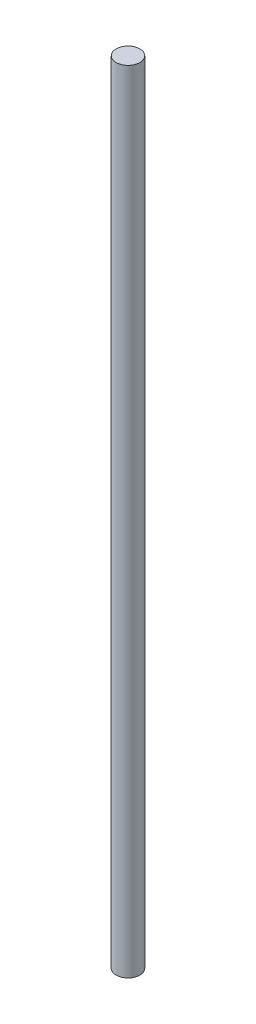
ISO-10303-21;
HEADER;
FILE_DESCRIPTION(('STEP AP214'),'2;1');
FILE_NAME('part.step','',(''),(''),'','','');
FILE_SCHEMA(('AUTOMOTIVE_DESIGN { 1 0 10303 214 1 1 1 1 }'));
ENDSEC;
DATA;
#1=APPLICATION_CONTEXT('core data for automotive mechanical design processes');
#2=APPLICATION_PROTOCOL_DEFINITION('international standard','automotive_design',2000,#1);
#3=PRODUCT_CONTEXT('',#1,'mechanical');
#4=PRODUCT('Part','Part','',(#3));
#5=PRODUCT_RELATED_PRODUCT_CATEGORY('part','',(#4));
#6=PRODUCT_DEFINITION_FORMATION('','',#4);
#7=PRODUCT_DEFINITION_CONTEXT('part definition',#1,'design');
#8=PRODUCT_DEFINITION('design','',#6,#7);
#9=PRODUCT_DEFINITION_SHAPE('','',#8);
#10=(LENGTH_UNIT() NAMED_UNIT(*) SI_UNIT(.MILLI.,.METRE.));
#11=(NAMED_UNIT(*) PLANE_ANGLE_UNIT() SI_UNIT($,.RADIAN.));
#12=(NAMED_UNIT(*) SI_UNIT($,.STERADIAN.) SOLID_ANGLE_UNIT());
#13=UNCERTAINTY_MEASURE_WITH_UNIT(LENGTH_MEASURE(1.E-05),#10,'distance_accuracy_value','');
#14=(GEOMETRIC_REPRESENTATION_CONTEXT(3) GLOBAL_UNCERTAINTY_ASSIGNED_CONTEXT((#13)) GLOBAL_UNIT_ASSIGNED_CONTEXT((#10,
#11,#12)) REPRESENTATION_CONTEXT('',''));
#15=CARTESIAN_POINT('',(0.,0.,0.));
#16=DIRECTION('',(0.,0.,1.));
#17=DIRECTION('',(1.,0.,0.));
#18=AXIS2_PLACEMENT_3D('',#15,#16,#17);
#19=CARTESIAN_POINT('',(0.,100.,0.));
#20=DIRECTION('',(0.,-1.,0.));
#21=DIRECTION('',(0.,0.,-1.));
#22=AXIS2_PLACEMENT_3D('',#19,#20,#21);
#23=CYLINDRICAL_SURFACE('',#22,1.5);
#24=CARTESIAN_POINT('',(0.,100.,0.));
#25=DIRECTION('',(0.,1.,0.));
#26=DIRECTION('',(0.,0.,1.));
#27=AXIS2_PLACEMENT_3D('',#24,#25,#26);
#28=CIRCLE('',#27,1.5);
#29=CARTESIAN_POINT('',(0.,100.,1.5));
#30=VERTEX_POINT('',#29);
#31=EDGE_CURVE('E10',#30,#30,#28,.T.);
#32=ORIENTED_EDGE('',*,*,#31,.F.);
#33=EDGE_LOOP('',(#32));
#34=FACE_BOUND('',#33,.T.);
#35=CARTESIAN_POINT('',(0.,0.,0.));
#36=DIRECTION('',(0.,1.,0.));
#37=DIRECTION('',(0.,0.,1.));
#38=AXIS2_PLACEMENT_3D('',#35,#36,#37);
#39=CIRCLE('',#38,1.5);
#40=CARTESIAN_POINT('',(0.,0.,1.5));
#41=VERTEX_POINT('',#40);
#42=EDGE_CURVE('E33',#41,#41,#39,.T.);
#43=ORIENTED_EDGE('',*,*,#42,.T.);
#44=EDGE_LOOP('',(#43));
#45=FACE_BOUND('',#44,.T.);
#46=ADVANCED_FACE('F30',(#34,#45),#23,.T.);
#47=CARTESIAN_POINT('',(0.,100.,0.));
#48=DIRECTION('',(0.,1.,0.));
#49=DIRECTION('',(0.,0.,1.));
#50=AXIS2_PLACEMENT_3D('',#47,#48,#49);
#51=PLANE('',#50);
#52=ORIENTED_EDGE('',*,*,#31,.T.);
#53=EDGE_LOOP('',(#52));
#54=FACE_BOUND('',#53,.T.);
#55=ADVANCED_FACE('F45',(#54),#51,.T.);
#56=CARTESIAN_POINT('',(0.,0.,0.));
#57=DIRECTION('',(0.,1.,0.));
#58=DIRECTION('',(0.,0.,1.));
#59=AXIS2_PLACEMENT_3D('',#56,#57,#58);
#60=PLANE('',#59);
#61=ORIENTED_EDGE('',*,*,#42,.F.);
#62=EDGE_LOOP('',(#61));
#63=FACE_BOUND('',#62,.T.);
#64=ADVANCED_FACE('F43',(#63),#60,.F.);
#65=CLOSED_SHELL('',(#46,#55,#64));
#66=MANIFOLD_SOLID_BREP('B2',#65);
#67=ADVANCED_BREP_SHAPE_REPRESENTATION('',(#18,#66),#14);
#68=SHAPE_DEFINITION_REPRESENTATION(#9,#67);
ENDSEC;
END-ISO-10303-21;
